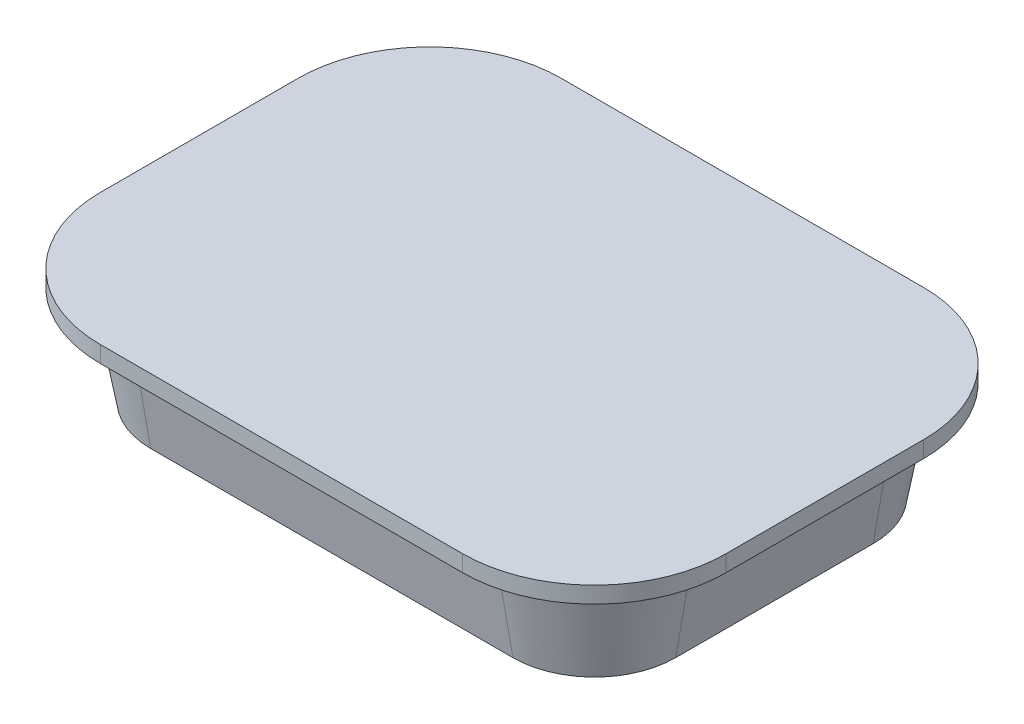
ISO-10303-21;
HEADER;
FILE_DESCRIPTION(('STEP AP214'),'2;1');
FILE_NAME('part.step','',(''),(''),'','','');
FILE_SCHEMA(('AUTOMOTIVE_DESIGN { 1 0 10303 214 1 1 1 1 }'));
ENDSEC;
DATA;
#1=APPLICATION_CONTEXT('core data for automotive mechanical design processes');
#2=APPLICATION_PROTOCOL_DEFINITION('international standard','automotive_design',2000,#1);
#3=PRODUCT_CONTEXT('',#1,'mechanical');
#4=PRODUCT('Part','Part','',(#3));
#5=PRODUCT_RELATED_PRODUCT_CATEGORY('part','',(#4));
#6=PRODUCT_DEFINITION_FORMATION('','',#4);
#7=PRODUCT_DEFINITION_CONTEXT('part definition',#1,'design');
#8=PRODUCT_DEFINITION('design','',#6,#7);
#9=PRODUCT_DEFINITION_SHAPE('','',#8);
#10=(LENGTH_UNIT() NAMED_UNIT(*) SI_UNIT(.MILLI.,.METRE.));
#11=(NAMED_UNIT(*) PLANE_ANGLE_UNIT() SI_UNIT($,.RADIAN.));
#12=(NAMED_UNIT(*) SI_UNIT($,.STERADIAN.) SOLID_ANGLE_UNIT());
#13=UNCERTAINTY_MEASURE_WITH_UNIT(LENGTH_MEASURE(1.E-05),#10,'distance_accuracy_value','');
#14=(GEOMETRIC_REPRESENTATION_CONTEXT(3) GLOBAL_UNCERTAINTY_ASSIGNED_CONTEXT((#13)) GLOBAL_UNIT_ASSIGNED_CONTEXT((#10,
#11,#12)) REPRESENTATION_CONTEXT('',''));
#15=CARTESIAN_POINT('',(0.,0.,0.));
#16=DIRECTION('',(0.,0.,1.));
#17=DIRECTION('',(1.,0.,0.));
#18=AXIS2_PLACEMENT_3D('',#15,#16,#17);
#19=CARTESIAN_POINT('',(0.,0.,0.));
#20=DIRECTION('',(0.,1.,0.));
#21=DIRECTION('',(0.,0.,1.));
#22=AXIS2_PLACEMENT_3D('',#19,#20,#21);
#23=PLANE('',#22);
#24=CARTESIAN_POINT('',(-55.,0.,-30.));
#25=DIRECTION('',(0.,1.,0.));
#26=DIRECTION('',(0.,0.,1.));
#27=AXIS2_PLACEMENT_3D('',#24,#25,#26);
#28=CIRCLE('',#27,40.);
#29=CARTESIAN_POINT('',(-95.,0.,-30.));
#30=VERTEX_POINT('',#29);
#31=CARTESIAN_POINT('',(-55.,0.,-70.));
#32=VERTEX_POINT('',#31);
#33=EDGE_CURVE('E232',#30,#32,#28,.F.);
#34=ORIENTED_EDGE('',*,*,#33,.T.);
#35=DIRECTION('',(1.,0.,0.));
#36=VECTOR('',#35,1.);
#37=CARTESIAN_POINT('',(0.,0.,-70.));
#38=LINE('',#37,#36);
#39=CARTESIAN_POINT('',(55.,0.,-70.));
#40=VERTEX_POINT('',#39);
#41=EDGE_CURVE('E269',#32,#40,#38,.T.);
#42=ORIENTED_EDGE('',*,*,#41,.T.);
#43=CARTESIAN_POINT('',(55.,0.,-30.));
#44=DIRECTION('',(0.,1.,0.));
#45=DIRECTION('',(0.,0.,1.));
#46=AXIS2_PLACEMENT_3D('',#43,#44,#45);
#47=CIRCLE('',#46,40.);
#48=CARTESIAN_POINT('',(95.,0.,-30.));
#49=VERTEX_POINT('',#48);
#50=EDGE_CURVE('E316',#40,#49,#47,.F.);
#51=ORIENTED_EDGE('',*,*,#50,.T.);
#52=DIRECTION('',(0.,0.,-1.));
#53=VECTOR('',#52,1.);
#54=CARTESIAN_POINT('',(95.,0.,0.));
#55=LINE('',#54,#53);
#56=CARTESIAN_POINT('',(95.,0.,30.));
#57=VERTEX_POINT('',#56);
#58=EDGE_CURVE('E312',#57,#49,#55,.T.);
#59=ORIENTED_EDGE('',*,*,#58,.F.);
#60=CARTESIAN_POINT('',(55.,0.,30.));
#61=DIRECTION('',(0.,1.,0.));
#62=DIRECTION('',(0.,0.,1.));
#63=AXIS2_PLACEMENT_3D('',#60,#61,#62);
#64=CIRCLE('',#63,40.);
#65=CARTESIAN_POINT('',(55.,0.,70.));
#66=VERTEX_POINT('',#65);
#67=EDGE_CURVE('E309',#66,#57,#64,.T.);
#68=ORIENTED_EDGE('',*,*,#67,.F.);
#69=DIRECTION('',(1.,0.,0.));
#70=VECTOR('',#69,1.);
#71=CARTESIAN_POINT('',(0.,0.,70.));
#72=LINE('',#71,#70);
#73=CARTESIAN_POINT('',(-55.,0.,70.));
#74=VERTEX_POINT('',#73);
#75=EDGE_CURVE('E306',#74,#66,#72,.T.);
#76=ORIENTED_EDGE('',*,*,#75,.F.);
#77=CARTESIAN_POINT('',(-55.,0.,30.));
#78=DIRECTION('',(0.,1.,0.));
#79=DIRECTION('',(0.,0.,1.));
#80=AXIS2_PLACEMENT_3D('',#77,#78,#79);
#81=CIRCLE('',#80,40.);
#82=CARTESIAN_POINT('',(-95.,0.,30.));
#83=VERTEX_POINT('',#82);
#84=EDGE_CURVE('E302',#74,#83,#81,.F.);
#85=ORIENTED_EDGE('',*,*,#84,.T.);
#86=DIRECTION('',(0.,0.,-1.));
#87=VECTOR('',#86,1.);
#88=CARTESIAN_POINT('',(-95.,0.,0.));
#89=LINE('',#88,#87);
#90=EDGE_CURVE('E298',#83,#30,#89,.T.);
#91=ORIENTED_EDGE('',*,*,#90,.T.);
#92=EDGE_LOOP('',(#34,#42,#51,#59,#68,#76,#85,#91));
#93=FACE_BOUND('',#92,.T.);
#94=CARTESIAN_POINT('',(-55.,0.,30.));
#95=DIRECTION('',(0.,-1.,0.));
#96=DIRECTION('',(0.,0.,-1.));
#97=AXIS2_PLACEMENT_3D('',#94,#95,#96);
#98=CIRCLE('',#97,30.);
#99=CARTESIAN_POINT('',(-55.,0.,60.));
#100=VERTEX_POINT('',#99);
#101=CARTESIAN_POINT('',(-85.,0.,30.));
#102=VERTEX_POINT('',#101);
#103=EDGE_CURVE('E205',#100,#102,#98,.T.);
#104=ORIENTED_EDGE('',*,*,#103,.F.);
#105=DIRECTION('',(1.,0.,0.));
#106=VECTOR('',#105,1.);
#107=CARTESIAN_POINT('',(-55.,0.,60.));
#108=LINE('',#107,#106);
#109=CARTESIAN_POINT('',(55.,0.,60.));
#110=VERTEX_POINT('',#109);
#111=EDGE_CURVE('E109',#100,#110,#108,.T.);
#112=ORIENTED_EDGE('',*,*,#111,.T.);
#113=CARTESIAN_POINT('',(55.,0.,30.));
#114=DIRECTION('',(0.,1.,0.));
#115=DIRECTION('',(0.,0.,1.));
#116=AXIS2_PLACEMENT_3D('',#113,#114,#115);
#117=CIRCLE('',#116,30.);
#118=CARTESIAN_POINT('',(85.,0.,30.));
#119=VERTEX_POINT('',#118);
#120=EDGE_CURVE('E114',#110,#119,#117,.T.);
#121=ORIENTED_EDGE('',*,*,#120,.T.);
#122=DIRECTION('',(0.,0.,-1.));
#123=VECTOR('',#122,1.);
#124=CARTESIAN_POINT('',(85.,0.,30.));
#125=LINE('',#124,#123);
#126=CARTESIAN_POINT('',(85.,0.,-30.));
#127=VERTEX_POINT('',#126);
#128=EDGE_CURVE('E569',#119,#127,#125,.T.);
#129=ORIENTED_EDGE('',*,*,#128,.T.);
#130=CARTESIAN_POINT('',(55.,0.,-30.));
#131=DIRECTION('',(0.,-1.,0.));
#132=DIRECTION('',(0.,0.,-1.));
#133=AXIS2_PLACEMENT_3D('',#130,#131,#132);
#134=CIRCLE('',#133,30.);
#135=CARTESIAN_POINT('',(55.,0.,-60.));
#136=VERTEX_POINT('',#135);
#137=EDGE_CURVE('E574',#136,#127,#134,.T.);
#138=ORIENTED_EDGE('',*,*,#137,.F.);
#139=DIRECTION('',(1.,0.,0.));
#140=VECTOR('',#139,1.);
#141=CARTESIAN_POINT('',(-55.,0.,-60.));
#142=LINE('',#141,#140);
#143=CARTESIAN_POINT('',(-55.,0.,-60.));
#144=VERTEX_POINT('',#143);
#145=EDGE_CURVE('E578',#144,#136,#142,.T.);
#146=ORIENTED_EDGE('',*,*,#145,.F.);
#147=CARTESIAN_POINT('',(-55.,0.,-30.));
#148=DIRECTION('',(0.,-1.,0.));
#149=DIRECTION('',(0.,0.,-1.));
#150=AXIS2_PLACEMENT_3D('',#147,#148,#149);
#151=CIRCLE('',#150,30.);
#152=CARTESIAN_POINT('',(-85.,0.,-30.));
#153=VERTEX_POINT('',#152);
#154=EDGE_CURVE('E208',#153,#144,#151,.T.);
#155=ORIENTED_EDGE('',*,*,#154,.F.);
#156=DIRECTION('',(0.,0.,-1.));
#157=VECTOR('',#156,1.);
#158=CARTESIAN_POINT('',(-85.,0.,30.));
#159=LINE('',#158,#157);
#160=EDGE_CURVE('E203',#102,#153,#159,.T.);
#161=ORIENTED_EDGE('',*,*,#160,.F.);
#162=EDGE_LOOP('',(#104,#112,#121,#129,#138,#146,#155,#161));
#163=FACE_BOUND('',#162,.T.);
#164=ADVANCED_FACE('F93',(#93,#163),#23,.F.);
#165=CARTESIAN_POINT('',(-95.,5.,0.));
#166=DIRECTION('',(-1.,0.,0.));
#167=DIRECTION('',(0.,0.,1.));
#168=AXIS2_PLACEMENT_3D('',#165,#166,#167);
#169=PLANE('',#168);
#170=ORIENTED_EDGE('',*,*,#90,.F.);
#171=DIRECTION('',(0.,-1.,0.));
#172=VECTOR('',#171,1.);
#173=CARTESIAN_POINT('',(-95.,5.,30.));
#174=LINE('',#173,#172);
#175=CARTESIAN_POINT('',(-95.,5.,30.));
#176=VERTEX_POINT('',#175);
#177=EDGE_CURVE('E102',#176,#83,#174,.T.);
#178=ORIENTED_EDGE('',*,*,#177,.F.);
#179=DIRECTION('',(0.,0.,-1.));
#180=VECTOR('',#179,1.);
#181=CARTESIAN_POINT('',(-95.,5.,0.));
#182=LINE('',#181,#180);
#183=CARTESIAN_POINT('',(-95.,5.,-30.));
#184=VERTEX_POINT('',#183);
#185=EDGE_CURVE('E268',#176,#184,#182,.T.);
#186=ORIENTED_EDGE('',*,*,#185,.T.);
#187=DIRECTION('',(0.,-1.,0.));
#188=VECTOR('',#187,1.);
#189=CARTESIAN_POINT('',(-95.,5.,-30.));
#190=LINE('',#189,#188);
#191=EDGE_CURVE('E12',#184,#30,#190,.T.);
#192=ORIENTED_EDGE('',*,*,#191,.T.);
#193=EDGE_LOOP('',(#170,#178,#186,#192));
#194=FACE_BOUND('',#193,.T.);
#195=ADVANCED_FACE('F349',(#194),#169,.T.);
#196=CARTESIAN_POINT('',(-55.,5.,30.));
#197=DIRECTION('',(0.,-1.,0.));
#198=DIRECTION('',(0.,0.,-1.));
#199=AXIS2_PLACEMENT_3D('',#196,#197,#198);
#200=CYLINDRICAL_SURFACE('',#199,40.);
#201=ORIENTED_EDGE('',*,*,#84,.F.);
#202=DIRECTION('',(0.,-1.,0.));
#203=VECTOR('',#202,1.);
#204=CARTESIAN_POINT('',(-55.,5.,70.));
#205=LINE('',#204,#203);
#206=CARTESIAN_POINT('',(-55.,5.,70.));
#207=VERTEX_POINT('',#206);
#208=EDGE_CURVE('E339',#207,#74,#205,.T.);
#209=ORIENTED_EDGE('',*,*,#208,.F.);
#210=CARTESIAN_POINT('',(-55.,5.,30.));
#211=DIRECTION('',(0.,1.,0.));
#212=DIRECTION('',(0.,0.,1.));
#213=AXIS2_PLACEMENT_3D('',#210,#211,#212);
#214=CIRCLE('',#213,40.);
#215=EDGE_CURVE('E273',#207,#176,#214,.F.);
#216=ORIENTED_EDGE('',*,*,#215,.T.);
#217=ORIENTED_EDGE('',*,*,#177,.T.);
#218=EDGE_LOOP('',(#201,#209,#216,#217));
#219=FACE_BOUND('',#218,.T.);
#220=ADVANCED_FACE('F345',(#219),#200,.T.);
#221=CARTESIAN_POINT('',(0.,5.,70.));
#222=DIRECTION('',(0.,0.,-1.));
#223=DIRECTION('',(-1.,0.,0.));
#224=AXIS2_PLACEMENT_3D('',#221,#222,#223);
#225=PLANE('',#224);
#226=ORIENTED_EDGE('',*,*,#75,.T.);
#227=DIRECTION('',(0.,-1.,0.));
#228=VECTOR('',#227,1.);
#229=CARTESIAN_POINT('',(55.,5.,70.));
#230=LINE('',#229,#228);
#231=CARTESIAN_POINT('',(55.,5.,70.));
#232=VERTEX_POINT('',#231);
#233=EDGE_CURVE('E335',#232,#66,#230,.T.);
#234=ORIENTED_EDGE('',*,*,#233,.F.);
#235=DIRECTION('',(1.,0.,0.));
#236=VECTOR('',#235,1.);
#237=CARTESIAN_POINT('',(0.,5.,70.));
#238=LINE('',#237,#236);
#239=EDGE_CURVE('E277',#207,#232,#238,.T.);
#240=ORIENTED_EDGE('',*,*,#239,.F.);
#241=ORIENTED_EDGE('',*,*,#208,.T.);
#242=EDGE_LOOP('',(#226,#234,#240,#241));
#243=FACE_BOUND('',#242,.T.);
#244=ADVANCED_FACE('F357',(#243),#225,.F.);
#245=CARTESIAN_POINT('',(55.,5.,30.));
#246=DIRECTION('',(0.,-1.,0.));
#247=DIRECTION('',(0.,0.,-1.));
#248=AXIS2_PLACEMENT_3D('',#245,#246,#247);
#249=CYLINDRICAL_SURFACE('',#248,40.);
#250=ORIENTED_EDGE('',*,*,#67,.T.);
#251=DIRECTION('',(0.,-1.,0.));
#252=VECTOR('',#251,1.);
#253=CARTESIAN_POINT('',(95.,5.,30.));
#254=LINE('',#253,#252);
#255=CARTESIAN_POINT('',(95.,5.,30.));
#256=VERTEX_POINT('',#255);
#257=EDGE_CURVE('E331',#256,#57,#254,.T.);
#258=ORIENTED_EDGE('',*,*,#257,.F.);
#259=CARTESIAN_POINT('',(55.,5.,30.));
#260=DIRECTION('',(0.,1.,0.));
#261=DIRECTION('',(0.,0.,1.));
#262=AXIS2_PLACEMENT_3D('',#259,#260,#261);
#263=CIRCLE('',#262,40.);
#264=EDGE_CURVE('E280',#232,#256,#263,.T.);
#265=ORIENTED_EDGE('',*,*,#264,.F.);
#266=ORIENTED_EDGE('',*,*,#233,.T.);
#267=EDGE_LOOP('',(#250,#258,#265,#266));
#268=FACE_BOUND('',#267,.T.);
#269=ADVANCED_FACE('F361',(#268),#249,.T.);
#270=CARTESIAN_POINT('',(95.,5.,0.));
#271=DIRECTION('',(-1.,0.,0.));
#272=DIRECTION('',(0.,0.,1.));
#273=AXIS2_PLACEMENT_3D('',#270,#271,#272);
#274=PLANE('',#273);
#275=ORIENTED_EDGE('',*,*,#58,.T.);
#276=DIRECTION('',(0.,-1.,0.));
#277=VECTOR('',#276,1.);
#278=CARTESIAN_POINT('',(95.,5.,-30.));
#279=LINE('',#278,#277);
#280=CARTESIAN_POINT('',(95.,5.,-30.));
#281=VERTEX_POINT('',#280);
#282=EDGE_CURVE('E328',#281,#49,#279,.T.);
#283=ORIENTED_EDGE('',*,*,#282,.F.);
#284=DIRECTION('',(0.,0.,-1.));
#285=VECTOR('',#284,1.);
#286=CARTESIAN_POINT('',(95.,5.,0.));
#287=LINE('',#286,#285);
#288=EDGE_CURVE('E283',#256,#281,#287,.T.);
#289=ORIENTED_EDGE('',*,*,#288,.F.);
#290=ORIENTED_EDGE('',*,*,#257,.T.);
#291=EDGE_LOOP('',(#275,#283,#289,#290));
#292=FACE_BOUND('',#291,.T.);
#293=ADVANCED_FACE('F378',(#292),#274,.F.);
#294=CARTESIAN_POINT('',(55.,5.,-30.));
#295=DIRECTION('',(0.,-1.,0.));
#296=DIRECTION('',(0.,0.,-1.));
#297=AXIS2_PLACEMENT_3D('',#294,#295,#296);
#298=CYLINDRICAL_SURFACE('',#297,40.);
#299=ORIENTED_EDGE('',*,*,#50,.F.);
#300=DIRECTION('',(0.,-1.,0.));
#301=VECTOR('',#300,1.);
#302=CARTESIAN_POINT('',(55.,5.,-70.));
#303=LINE('',#302,#301);
#304=CARTESIAN_POINT('',(55.,5.,-70.));
#305=VERTEX_POINT('',#304);
#306=EDGE_CURVE('E325',#305,#40,#303,.T.);
#307=ORIENTED_EDGE('',*,*,#306,.F.);
#308=CARTESIAN_POINT('',(55.,5.,-30.));
#309=DIRECTION('',(0.,1.,0.));
#310=DIRECTION('',(0.,0.,1.));
#311=AXIS2_PLACEMENT_3D('',#308,#309,#310);
#312=CIRCLE('',#311,40.);
#313=EDGE_CURVE('E286',#305,#281,#312,.F.);
#314=ORIENTED_EDGE('',*,*,#313,.T.);
#315=ORIENTED_EDGE('',*,*,#282,.T.);
#316=EDGE_LOOP('',(#299,#307,#314,#315));
#317=FACE_BOUND('',#316,.T.);
#318=ADVANCED_FACE('F376',(#317),#298,.T.);
#319=CARTESIAN_POINT('',(0.,5.,-70.));
#320=DIRECTION('',(0.,0.,-1.));
#321=DIRECTION('',(-1.,0.,0.));
#322=AXIS2_PLACEMENT_3D('',#319,#320,#321);
#323=PLANE('',#322);
#324=ORIENTED_EDGE('',*,*,#41,.F.);
#325=DIRECTION('',(0.,-1.,0.));
#326=VECTOR('',#325,1.);
#327=CARTESIAN_POINT('',(-55.,5.,-70.));
#328=LINE('',#327,#326);
#329=CARTESIAN_POINT('',(-55.,5.,-70.));
#330=VERTEX_POINT('',#329);
#331=EDGE_CURVE('E294',#330,#32,#328,.T.);
#332=ORIENTED_EDGE('',*,*,#331,.F.);
#333=DIRECTION('',(1.,0.,0.));
#334=VECTOR('',#333,1.);
#335=CARTESIAN_POINT('',(0.,5.,-70.));
#336=LINE('',#335,#334);
#337=EDGE_CURVE('E290',#330,#305,#336,.T.);
#338=ORIENTED_EDGE('',*,*,#337,.T.);
#339=ORIENTED_EDGE('',*,*,#306,.T.);
#340=EDGE_LOOP('',(#324,#332,#338,#339));
#341=FACE_BOUND('',#340,.T.);
#342=ADVANCED_FACE('F373',(#341),#323,.T.);
#343=CARTESIAN_POINT('',(-55.,5.,-30.));
#344=DIRECTION('',(0.,-1.,0.));
#345=DIRECTION('',(0.,0.,-1.));
#346=AXIS2_PLACEMENT_3D('',#343,#344,#345);
#347=CYLINDRICAL_SURFACE('',#346,40.);
#348=ORIENTED_EDGE('',*,*,#33,.F.);
#349=ORIENTED_EDGE('',*,*,#191,.F.);
#350=CARTESIAN_POINT('',(-55.,5.,-30.));
#351=DIRECTION('',(0.,1.,0.));
#352=DIRECTION('',(0.,0.,1.));
#353=AXIS2_PLACEMENT_3D('',#350,#351,#352);
#354=CIRCLE('',#353,40.);
#355=EDGE_CURVE('E264',#184,#330,#354,.F.);
#356=ORIENTED_EDGE('',*,*,#355,.T.);
#357=ORIENTED_EDGE('',*,*,#331,.T.);
#358=EDGE_LOOP('',(#348,#349,#356,#357));
#359=FACE_BOUND('',#358,.T.);
#360=ADVANCED_FACE('F95',(#359),#347,.T.);
#361=CARTESIAN_POINT('',(0.,5.,0.));
#362=DIRECTION('',(0.,1.,0.));
#363=DIRECTION('',(0.,0.,1.));
#364=AXIS2_PLACEMENT_3D('',#361,#362,#363);
#365=PLANE('',#364);
#366=ORIENTED_EDGE('',*,*,#355,.F.);
#367=ORIENTED_EDGE('',*,*,#185,.F.);
#368=ORIENTED_EDGE('',*,*,#215,.F.);
#369=ORIENTED_EDGE('',*,*,#239,.T.);
#370=ORIENTED_EDGE('',*,*,#264,.T.);
#371=ORIENTED_EDGE('',*,*,#288,.T.);
#372=ORIENTED_EDGE('',*,*,#313,.F.);
#373=ORIENTED_EDGE('',*,*,#337,.F.);
#374=EDGE_LOOP('',(#366,#367,#368,#369,#370,#371,#372,#373));
#375=FACE_BOUND('',#374,.T.);
#376=ADVANCED_FACE('F366',(#375),#365,.T.);
#377=CARTESIAN_POINT('',(-55.,0.,60.));
#378=DIRECTION('',(0.,-0.17364817766693,0.984807753012208));
#379=DIRECTION('',(0.,-0.984807753012208,-0.17364817766693));
#380=AXIS2_PLACEMENT_3D('',#377,#378,#379);
#381=PLANE('',#380);
#382=ORIENTED_EDGE('',*,*,#111,.F.);
#383=DIRECTION('',(0.,0.984807753012208,0.17364817766693));
#384=VECTOR('',#383,1.);
#385=CARTESIAN_POINT('',(-55.,0.,60.));
#386=LINE('',#385,#384);
#387=CARTESIAN_POINT('',(-55.,-30.,54.7101905787461));
#388=VERTEX_POINT('',#387);
#389=EDGE_CURVE('E221',#388,#100,#386,.T.);
#390=ORIENTED_EDGE('',*,*,#389,.F.);
#391=DIRECTION('',(1.,0.,0.));
#392=VECTOR('',#391,1.);
#393=CARTESIAN_POINT('',(55.,-30.,54.7101905787461));
#394=LINE('',#393,#392);
#395=CARTESIAN_POINT('',(55.0000000000001,-30.,54.7101905787461));
#396=VERTEX_POINT('',#395);
#397=EDGE_CURVE('E223',#388,#396,#394,.T.);
#398=ORIENTED_EDGE('',*,*,#397,.T.);
#399=DIRECTION('',(0.,0.984807753012208,0.17364817766693));
#400=VECTOR('',#399,1.);
#401=CARTESIAN_POINT('',(55.0000000000001,0.,60.));
#402=LINE('',#401,#400);
#403=EDGE_CURVE('E245',#396,#110,#402,.T.);
#404=ORIENTED_EDGE('',*,*,#403,.T.);
#405=EDGE_LOOP('',(#382,#390,#398,#404));
#406=FACE_BOUND('',#405,.T.);
#407=ADVANCED_FACE('F402',(#406),#381,.T.);
#408=CARTESIAN_POINT('',(-55.,0.,30.));
#409=DIRECTION('',(0.,1.,0.));
#410=DIRECTION('',(0.,0.,-1.));
#411=AXIS2_PLACEMENT_3D('',#408,#409,#410);
#412=CONICAL_SURFACE('',#411,30.,0.174532925199433);
#413=ORIENTED_EDGE('',*,*,#103,.T.);
#414=DIRECTION('',(-0.17364817766693,0.984807753012208,0.));
#415=VECTOR('',#414,1.);
#416=CARTESIAN_POINT('',(-85.,0.,30.));
#417=LINE('',#416,#415);
#418=CARTESIAN_POINT('',(-79.710190578746,-30.,30.));
#419=VERTEX_POINT('',#418);
#420=EDGE_CURVE('E219',#419,#102,#417,.T.);
#421=ORIENTED_EDGE('',*,*,#420,.F.);
#422=CARTESIAN_POINT('',(-55.,-30.,30.));
#423=DIRECTION('',(0.,1.,0.));
#424=DIRECTION('',(0.,0.,1.));
#425=AXIS2_PLACEMENT_3D('',#422,#423,#424);
#426=CIRCLE('',#425,24.710190578746);
#427=EDGE_CURVE('E242',#388,#419,#426,.F.);
#428=ORIENTED_EDGE('',*,*,#427,.F.);
#429=ORIENTED_EDGE('',*,*,#389,.T.);
#430=EDGE_LOOP('',(#413,#421,#428,#429));
#431=FACE_BOUND('',#430,.T.);
#432=ADVANCED_FACE('F217',(#431),#412,.T.);
#433=CARTESIAN_POINT('',(-85.,0.,30.));
#434=DIRECTION('',(-0.984807753012208,-0.17364817766693,0.));
#435=DIRECTION('',(0.17364817766693,-0.984807753012208,0.));
#436=AXIS2_PLACEMENT_3D('',#433,#434,#435);
#437=PLANE('',#436);
#438=ORIENTED_EDGE('',*,*,#160,.T.);
#439=DIRECTION('',(-0.17364817766693,0.984807753012208,0.));
#440=VECTOR('',#439,1.);
#441=CARTESIAN_POINT('',(-85.,0.,-30.));
#442=LINE('',#441,#440);
#443=CARTESIAN_POINT('',(-79.710190578746,-30.,-30.));
#444=VERTEX_POINT('',#443);
#445=EDGE_CURVE('E228',#444,#153,#442,.T.);
#446=ORIENTED_EDGE('',*,*,#445,.F.);
#447=DIRECTION('',(0.,0.,1.));
#448=VECTOR('',#447,1.);
#449=CARTESIAN_POINT('',(-79.710190578746,-30.,30.));
#450=LINE('',#449,#448);
#451=EDGE_CURVE('E226',#419,#444,#450,.F.);
#452=ORIENTED_EDGE('',*,*,#451,.F.);
#453=ORIENTED_EDGE('',*,*,#420,.T.);
#454=EDGE_LOOP('',(#438,#446,#452,#453));
#455=FACE_BOUND('',#454,.T.);
#456=ADVANCED_FACE('F225',(#455),#437,.T.);
#457=CARTESIAN_POINT('',(-55.,0.,-30.));
#458=DIRECTION('',(0.,1.,0.));
#459=DIRECTION('',(0.,0.,-1.));
#460=AXIS2_PLACEMENT_3D('',#457,#458,#459);
#461=CONICAL_SURFACE('',#460,30.,0.174532925199433);
#462=ORIENTED_EDGE('',*,*,#154,.T.);
#463=DIRECTION('',(0.,0.984807753012208,-0.17364817766693));
#464=VECTOR('',#463,1.);
#465=CARTESIAN_POINT('',(-55.,0.,-60.));
#466=LINE('',#465,#464);
#467=CARTESIAN_POINT('',(-55.,-30.,-54.710190578746));
#468=VERTEX_POINT('',#467);
#469=EDGE_CURVE('E234',#468,#144,#466,.T.);
#470=ORIENTED_EDGE('',*,*,#469,.F.);
#471=CARTESIAN_POINT('',(-55.,-30.,-30.));
#472=DIRECTION('',(0.,1.,0.));
#473=DIRECTION('',(0.,0.,1.));
#474=AXIS2_PLACEMENT_3D('',#471,#472,#473);
#475=CIRCLE('',#474,24.710190578746);
#476=EDGE_CURVE('E248',#444,#468,#475,.F.);
#477=ORIENTED_EDGE('',*,*,#476,.F.);
#478=ORIENTED_EDGE('',*,*,#445,.T.);
#479=EDGE_LOOP('',(#462,#470,#477,#478));
#480=FACE_BOUND('',#479,.T.);
#481=ADVANCED_FACE('F429',(#480),#461,.T.);
#482=CARTESIAN_POINT('',(-55.,0.,-60.));
#483=DIRECTION('',(0.,-0.17364817766693,-0.984807753012208));
#484=DIRECTION('',(0.,0.984807753012208,-0.17364817766693));
#485=AXIS2_PLACEMENT_3D('',#482,#483,#484);
#486=PLANE('',#485);
#487=ORIENTED_EDGE('',*,*,#145,.T.);
#488=DIRECTION('',(0.,0.984807753012208,-0.17364817766693));
#489=VECTOR('',#488,1.);
#490=CARTESIAN_POINT('',(55.,0.,-60.));
#491=LINE('',#490,#489);
#492=CARTESIAN_POINT('',(55.,-30.,-54.710190578746));
#493=VERTEX_POINT('',#492);
#494=EDGE_CURVE('E593',#493,#136,#491,.T.);
#495=ORIENTED_EDGE('',*,*,#494,.F.);
#496=DIRECTION('',(-1.,0.,0.));
#497=VECTOR('',#496,1.);
#498=CARTESIAN_POINT('',(55.,-30.,-54.710190578746));
#499=LINE('',#498,#497);
#500=EDGE_CURVE('E251',#468,#493,#499,.F.);
#501=ORIENTED_EDGE('',*,*,#500,.F.);
#502=ORIENTED_EDGE('',*,*,#469,.T.);
#503=EDGE_LOOP('',(#487,#495,#501,#502));
#504=FACE_BOUND('',#503,.T.);
#505=ADVANCED_FACE('F425',(#504),#486,.T.);
#506=CARTESIAN_POINT('',(55.,0.,-30.));
#507=DIRECTION('',(0.,1.,0.));
#508=DIRECTION('',(0.,0.,-1.));
#509=AXIS2_PLACEMENT_3D('',#506,#507,#508);
#510=CONICAL_SURFACE('',#509,30.,0.174532925199433);
#511=ORIENTED_EDGE('',*,*,#137,.T.);
#512=DIRECTION('',(0.17364817766693,0.984807753012208,0.));
#513=VECTOR('',#512,1.);
#514=CARTESIAN_POINT('',(85.,0.,-30.));
#515=LINE('',#514,#513);
#516=CARTESIAN_POINT('',(79.7101905787461,-30.,-30.));
#517=VERTEX_POINT('',#516);
#518=EDGE_CURVE('E589',#517,#127,#515,.T.);
#519=ORIENTED_EDGE('',*,*,#518,.F.);
#520=CARTESIAN_POINT('',(55.,-30.,-30.));
#521=DIRECTION('',(0.,1.,0.));
#522=DIRECTION('',(0.,0.,1.));
#523=AXIS2_PLACEMENT_3D('',#520,#521,#522);
#524=CIRCLE('',#523,24.710190578746);
#525=EDGE_CURVE('E254',#493,#517,#524,.F.);
#526=ORIENTED_EDGE('',*,*,#525,.F.);
#527=ORIENTED_EDGE('',*,*,#494,.T.);
#528=EDGE_LOOP('',(#511,#519,#526,#527));
#529=FACE_BOUND('',#528,.T.);
#530=ADVANCED_FACE('F421',(#529),#510,.T.);
#531=CARTESIAN_POINT('',(85.,0.,30.));
#532=DIRECTION('',(0.984807753012208,-0.17364817766693,0.));
#533=DIRECTION('',(0.17364817766693,0.984807753012208,0.));
#534=AXIS2_PLACEMENT_3D('',#531,#532,#533);
#535=PLANE('',#534);
#536=ORIENTED_EDGE('',*,*,#128,.F.);
#537=DIRECTION('',(0.17364817766693,0.984807753012208,0.));
#538=VECTOR('',#537,1.);
#539=CARTESIAN_POINT('',(85.,0.,30.));
#540=LINE('',#539,#538);
#541=CARTESIAN_POINT('',(79.7101905787461,-30.,30.));
#542=VERTEX_POINT('',#541);
#543=EDGE_CURVE('E586',#542,#119,#540,.T.);
#544=ORIENTED_EDGE('',*,*,#543,.F.);
#545=DIRECTION('',(0.,0.,-1.));
#546=VECTOR('',#545,1.);
#547=CARTESIAN_POINT('',(79.7101905787461,-30.,30.));
#548=LINE('',#547,#546);
#549=EDGE_CURVE('E257',#542,#517,#548,.T.);
#550=ORIENTED_EDGE('',*,*,#549,.T.);
#551=ORIENTED_EDGE('',*,*,#518,.T.);
#552=EDGE_LOOP('',(#536,#544,#550,#551));
#553=FACE_BOUND('',#552,.T.);
#554=ADVANCED_FACE('F417',(#553),#535,.T.);
#555=CARTESIAN_POINT('',(55.,0.,30.));
#556=DIRECTION('',(0.,1.,0.));
#557=DIRECTION('',(0.,0.,1.));
#558=AXIS2_PLACEMENT_3D('',#555,#556,#557);
#559=CONICAL_SURFACE('',#558,30.,0.174532925199433);
#560=ORIENTED_EDGE('',*,*,#120,.F.);
#561=ORIENTED_EDGE('',*,*,#403,.F.);
#562=CARTESIAN_POINT('',(55.,-30.,30.));
#563=DIRECTION('',(0.,1.,0.));
#564=DIRECTION('',(0.,0.,1.));
#565=AXIS2_PLACEMENT_3D('',#562,#563,#564);
#566=CIRCLE('',#565,24.710190578746);
#567=EDGE_CURVE('E241',#396,#542,#566,.T.);
#568=ORIENTED_EDGE('',*,*,#567,.T.);
#569=ORIENTED_EDGE('',*,*,#543,.T.);
#570=EDGE_LOOP('',(#560,#561,#568,#569));
#571=FACE_BOUND('',#570,.T.);
#572=ADVANCED_FACE('F414',(#571),#559,.T.);
#573=CARTESIAN_POINT('',(55.,-30.,30.));
#574=DIRECTION('',(0.,1.,0.));
#575=DIRECTION('',(0.,0.,1.));
#576=AXIS2_PLACEMENT_3D('',#573,#574,#575);
#577=PLANE('',#576);
#578=ORIENTED_EDGE('',*,*,#397,.F.);
#579=ORIENTED_EDGE('',*,*,#427,.T.);
#580=ORIENTED_EDGE('',*,*,#451,.T.);
#581=ORIENTED_EDGE('',*,*,#476,.T.);
#582=ORIENTED_EDGE('',*,*,#500,.T.);
#583=ORIENTED_EDGE('',*,*,#525,.T.);
#584=ORIENTED_EDGE('',*,*,#549,.F.);
#585=ORIENTED_EDGE('',*,*,#567,.F.);
#586=EDGE_LOOP('',(#578,#579,#580,#581,#582,#583,#584,#585));
#587=FACE_BOUND('',#586,.T.);
#588=ADVANCED_FACE('F413',(#587),#577,.F.);
#589=CLOSED_SHELL('',(#164,#195,#220,#244,#269,#293,#318,#342,#360,#376,#407,#432,#456,#481,
#505,#530,#554,#572,#588));
#590=MANIFOLD_SOLID_BREP('B2',#589);
#591=ADVANCED_BREP_SHAPE_REPRESENTATION('',(#18,#590),#14);
#592=SHAPE_DEFINITION_REPRESENTATION(#9,#591);
ENDSEC;
END-ISO-10303-21;
